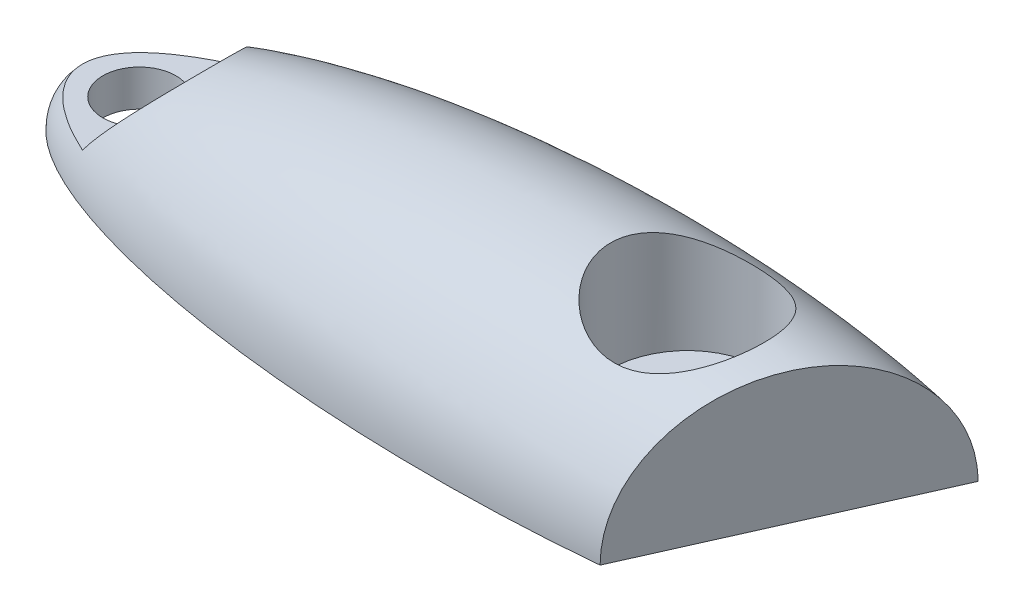
ISO-10303-21;
HEADER;
FILE_DESCRIPTION(('STEP AP214'),'2;1');
FILE_NAME('part.step','',(''),(''),'','','');
FILE_SCHEMA(('AUTOMOTIVE_DESIGN { 1 0 10303 214 1 1 1 1 }'));
ENDSEC;
DATA;
#1=APPLICATION_CONTEXT('core data for automotive mechanical design processes');
#2=APPLICATION_PROTOCOL_DEFINITION('international standard','automotive_design',2000,#1);
#3=PRODUCT_CONTEXT('',#1,'mechanical');
#4=PRODUCT('Part','Part','',(#3));
#5=PRODUCT_RELATED_PRODUCT_CATEGORY('part','',(#4));
#6=PRODUCT_DEFINITION_FORMATION('','',#4);
#7=PRODUCT_DEFINITION_CONTEXT('part definition',#1,'design');
#8=PRODUCT_DEFINITION('design','',#6,#7);
#9=PRODUCT_DEFINITION_SHAPE('','',#8);
#10=(LENGTH_UNIT() NAMED_UNIT(*) SI_UNIT(.MILLI.,.METRE.));
#11=(NAMED_UNIT(*) PLANE_ANGLE_UNIT() SI_UNIT($,.RADIAN.));
#12=(NAMED_UNIT(*) SI_UNIT($,.STERADIAN.) SOLID_ANGLE_UNIT());
#13=UNCERTAINTY_MEASURE_WITH_UNIT(LENGTH_MEASURE(1.E-05),#10,'distance_accuracy_value','');
#14=(GEOMETRIC_REPRESENTATION_CONTEXT(3) GLOBAL_UNCERTAINTY_ASSIGNED_CONTEXT((#13)) GLOBAL_UNIT_ASSIGNED_CONTEXT((#10,
#11,#12)) REPRESENTATION_CONTEXT('',''));
#15=CARTESIAN_POINT('',(0.,0.,0.));
#16=DIRECTION('',(0.,0.,1.));
#17=DIRECTION('',(1.,0.,0.));
#18=AXIS2_PLACEMENT_3D('',#15,#16,#17);
#19=CARTESIAN_POINT('',(0.,0.,0.));
#20=DIRECTION('',(0.,0.,1.));
#21=DIRECTION('',(1.,0.,0.));
#22=AXIS2_PLACEMENT_3D('',#19,#20,#21);
#23=ELLIPSE('',#22,14.,4.);
#24=TRIMMED_CURVE('',#23,(PARAMETER_VALUE(0.)),(PARAMETER_VALUE(3.14159265358979)),.T.,.PARAMETER.);
#25=CARTESIAN_POINT('',(-14.,0.,0.));
#26=DIRECTION('',(-1.,0.,0.));
#27=AXIS1_PLACEMENT('',#25,#26);
#28=SURFACE_OF_REVOLUTION('',#24,#27);
#29=CARTESIAN_POINT('',(-11.3323951907794,1.,2.1252));
#30=CARTESIAN_POINT('',(-11.4265744042541,1.,2.08417845847968));
#31=CARTESIAN_POINT('',(-11.5201698550588,1.,2.04176190730122));
#32=CARTESIAN_POINT('',(-11.7066294634315,1.,1.95329424459177));
#33=CARTESIAN_POINT('',(-11.7994800204758,1.,1.90721453449926));
#34=CARTESIAN_POINT('',(-11.9835471465858,1.,1.81110875110348));
#35=CARTESIAN_POINT('',(-12.0747567610729,1.,1.76106927455102));
#36=CARTESIAN_POINT('',(-12.259066942138,1.,1.65396510442188));
#37=CARTESIAN_POINT('',(-12.3520379175605,1.,1.59667535699381));
#38=CARTESIAN_POINT('',(-12.5339079018473,1.,1.47644312667415));
#39=CARTESIAN_POINT('',(-12.6228174805613,1.,1.41351674791652));
#40=CARTESIAN_POINT('',(-12.7951436133261,1.,1.28080462101648));
#41=CARTESIAN_POINT('',(-12.87857282396,1.,1.21103567724105));
#42=CARTESIAN_POINT('',(-12.9968432799639,1.,1.10099736436021));
#43=CARTESIAN_POINT('',(-13.0346735351993,1.,1.06393370969369));
#44=CARTESIAN_POINT('',(-13.10806733959,1.,0.987588364844233));
#45=CARTESIAN_POINT('',(-13.1436301768897,1.,0.948305985321438));
#46=CARTESIAN_POINT('',(-13.2117086116156,1.,0.867635183153819));
#47=CARTESIAN_POINT('',(-13.2442437659799,1.,0.826263395193402));
#48=CARTESIAN_POINT('',(-13.3058674281841,1.,0.74104537546988));
#49=CARTESIAN_POINT('',(-13.3349574863987,1.,0.697200269973906));
#50=CARTESIAN_POINT('',(-13.3991601394723,1.,0.589804203011926));
#51=CARTESIAN_POINT('',(-13.4323712443251,1.,0.525087327016342));
#52=CARTESIAN_POINT('',(-13.488192959068,1.,0.391125975155837));
#53=CARTESIAN_POINT('',(-13.5108109132442,1.,0.321884674163175));
#54=CARTESIAN_POINT('',(-13.5350353613219,1.,0.215454699559348));
#55=CARTESIAN_POINT('',(-13.5415016370635,1.,0.179337120401642));
#56=CARTESIAN_POINT('',(-13.5508972872285,1.,0.106651402143992));
#57=CARTESIAN_POINT('',(-13.5538283733748,1.,0.0700834897652159));
#58=CARTESIAN_POINT('',(-13.5560433121289,1.,-0.00316459548426473));
#59=CARTESIAN_POINT('',(-13.555327061842,1.,-0.0398447714928582));
#60=CARTESIAN_POINT('',(-13.5502817408031,1.,-0.112944648592692));
#61=CARTESIAN_POINT('',(-13.5459528737572,1.,-0.149364364253835));
#62=CARTESIAN_POINT('',(-13.5294250255249,1.,-0.247784835462933));
#63=CARTESIAN_POINT('',(-13.5137981809939,1.,-0.30923301865574));
#64=CARTESIAN_POINT('',(-13.4736549583255,1.,-0.429070233913826));
#65=CARTESIAN_POINT('',(-13.4491349804836,0.999999999999999,-0.487458016241136));
#66=CARTESIAN_POINT('',(-13.3756607173964,0.999999999999999,-0.635419242339245));
#67=CARTESIAN_POINT('',(-13.3209490400327,1.,-0.722119170667468));
#68=CARTESIAN_POINT('',(-13.1990455326632,1.,-0.886274419623377));
#69=CARTESIAN_POINT('',(-13.1318116413938,1.,-0.963697094117582));
#70=CARTESIAN_POINT('',(-12.9918230113215,1.,-1.10760006513132));
#71=CARTESIAN_POINT('',(-12.9193753805795,1.,-1.17438448311408));
#72=CARTESIAN_POINT('',(-12.7690974455616,1.,-1.30166180433138));
#73=CARTESIAN_POINT('',(-12.6912617166786,1.,-1.3621482088832));
#74=CARTESIAN_POINT('',(-12.5315112146063,1.,-1.4779685727839));
#75=CARTESIAN_POINT('',(-12.4495844326044,1.,-1.53328580631296));
#76=CARTESIAN_POINT('',(-12.2829007962956,1.,-1.6393545601126));
#77=CARTESIAN_POINT('',(-12.1981451381463,1.,-1.69010797742843));
#78=CARTESIAN_POINT('',(-11.9854869428068,1.,-1.8110332846165));
#79=CARTESIAN_POINT('',(-11.8562859594855,1.,-1.87892126127393));
#80=CARTESIAN_POINT('',(-11.6606616601892,1.,-1.97526559532136));
#81=CARTESIAN_POINT('',(-11.5954890885228,1.,-2.00632007432792));
#82=CARTESIAN_POINT('',(-11.4644449291603,1.,-2.06688197656395));
#83=CARTESIAN_POINT('',(-11.3985734911482,1.,-2.09638972334078));
#84=CARTESIAN_POINT('',(-11.3323951907794,1.,-2.1252));
#85=B_SPLINE_CURVE_WITH_KNOTS('',3,(#29,#30,#31,#32,#33,#34,#35,#36,#37,#38,#39,#40,#41,#42,#43,
#44,#45,#46,#47,#48,#49,#50,#51,#52,#53,#54,#55,#56,#57,#58,#59,#60,#61,#62,#63,#64,#65,#66,#67,
#68,#69,#70,#71,#72,#73,#74,#75,#76,#77,#78,#79,#80,#81,#82,#83,#84),.UNSPECIFIED.,.F.,.F.,(4,2,
2,2,2,2,2,2,2,2,2,2,2,2,2,2,2,2,2,2,2,2,2,2,2,2,2,4),(0.,0.308197864774815,0.619097115936735,
0.931097858750423,1.2585298228343,1.58505444508221,1.91079634639933,2.06960329763821,
2.22845986326112,2.38620637436928,2.54388162386346,2.76136992867584,2.97870722369306,
3.08863375203131,3.19850703304976,3.30838341371417,3.41825359915258,3.60760056996466,
3.7970242690986,4.10279876041959,4.40961948220797,4.70477437588822,5.00023087192482,
5.29661247194653,5.59287029972253,6.03042932247871,6.24699528805515,6.4635157698154),.UNSPECIFIED.);
#86=CARTESIAN_POINT('',(-11.5153947870645,1.,2.04332028512314));
#87=VERTEX_POINT('',#86);
#88=CARTESIAN_POINT('',(-11.5153947870645,1.,-2.04332028512313));
#89=VERTEX_POINT('',#88);
#90=EDGE_CURVE('E87',#87,#89,#85,.T.);
#91=ORIENTED_EDGE('',*,*,#90,.T.);
#92=CARTESIAN_POINT('',(-11.5153947870646,0.999999999999987,-2.04332028512314));
#93=CARTESIAN_POINT('',(-11.4859601713284,1.04190691100927,-2.03634523885614));
#94=CARTESIAN_POINT('',(-11.455939965631,1.08325950903699,-2.0285482251181));
#95=CARTESIAN_POINT('',(-11.3950274299691,1.16494465651603,-2.01121960072317));
#96=CARTESIAN_POINT('',(-11.3641351336836,1.20527724524499,-2.00168805697427));
#97=CARTESIAN_POINT('',(-11.3017245722681,1.28507884938627,-1.98078224239599));
#98=CARTESIAN_POINT('',(-11.2702053729221,1.32454635765365,-1.9694050071591));
#99=CARTESIAN_POINT('',(-11.2068188808601,1.40259172445675,-1.94474175527424));
#100=CARTESIAN_POINT('',(-11.1749515845317,1.44116957374683,-1.93145571879971));
#101=CARTESIAN_POINT('',(-11.0784092489901,1.55646704057423,-1.8882991714598));
#102=CARTESIAN_POINT('',(-11.0134943498303,1.63186758948024,-1.85535794092941));
#103=CARTESIAN_POINT('',(-10.8845250022668,1.77893399267751,-1.78080450727697));
#104=CARTESIAN_POINT('',(-10.8204698814206,1.85060290915535,-1.73919955840844));
#105=CARTESIAN_POINT('',(-10.7158093568559,1.96619043125952,-1.6623854108554));
#106=CARTESIAN_POINT('',(-10.6746024290106,2.01129405071702,-1.62977474945113));
#107=CARTESIAN_POINT('',(-10.593534182508,2.0994094031302,-1.56035415495191));
#108=CARTESIAN_POINT('',(-10.5536728704922,2.14242112576143,-1.52354420113458));
#109=CARTESIAN_POINT('',(-10.4370280416457,2.26757991065072,-1.40683070422024));
#110=CARTESIAN_POINT('',(-10.3628007176528,2.34627012824012,-1.32037110380086));
#111=CARTESIAN_POINT('',(-10.2413323694239,2.47414760496976,-1.15122792435654));
#112=CARTESIAN_POINT('',(-10.191797896957,2.52597016712455,-1.07218205439318));
#113=CARTESIAN_POINT('',(-10.1019159733054,2.61964813176993,-0.903531280911849));
#114=CARTESIAN_POINT('',(-10.0615608186204,2.66151189328356,-0.813935327836523));
#115=CARTESIAN_POINT('',(-9.99875156767703,2.72651627680485,-0.641796442949267));
#116=CARTESIAN_POINT('',(-9.97441195385856,2.75163921406036,-0.560693381317898));
#117=CARTESIAN_POINT('',(-9.93546616865047,2.79179367978033,-0.393719040930144));
#118=CARTESIAN_POINT('',(-9.9208532785694,2.8068321740827,-0.307851098003317));
#119=CARTESIAN_POINT('',(-9.90702346523332,2.82106017038962,-0.177180620327057));
#120=CARTESIAN_POINT('',(-9.90376387437008,2.82441237894233,-0.133198605734579));
#121=CARTESIAN_POINT('',(-9.90001807971665,2.8282643029202,-0.0449982264146429));
#122=CARTESIAN_POINT('',(-9.8995315457145,2.82876435797605,-0.000779890455715579));
#123=CARTESIAN_POINT('',(-9.90228087265955,2.82593778736616,0.131683714520757));
#124=CARTESIAN_POINT('',(-9.90971654018422,2.81829380344192,0.219823710555703));
#125=CARTESIAN_POINT('',(-9.93438925588672,2.79289626974398,0.387276021865792));
#126=CARTESIAN_POINT('',(-9.95097600742219,2.77581336178292,0.466793945712482));
#127=CARTESIAN_POINT('',(-9.99241963409492,2.73304738248871,0.621305808670344));
#128=CARTESIAN_POINT('',(-10.0172854467838,2.70735501673434,0.696294754776754));
#129=CARTESIAN_POINT('',(-10.0647052410367,2.65822751792861,0.816924487591546));
#130=CARTESIAN_POINT('',(-10.085368155482,2.63678918285027,0.864160316637053));
#131=CARTESIAN_POINT('',(-10.1294239921442,2.59098366698801,0.955785155020519));
#132=CARTESIAN_POINT('',(-10.152814354735,2.56661923162627,1.00017677388437));
#133=CARTESIAN_POINT('',(-10.2265983197503,2.48956964903853,1.12909668341846));
#134=CARTESIAN_POINT('',(-10.2805637749789,2.43297055893204,1.20926917572554));
#135=CARTESIAN_POINT('',(-10.4161908289538,2.28971041137473,1.384907184107));
#136=CARTESIAN_POINT('',(-10.5007745767453,2.1996146441049,1.47528330430638));
#137=CARTESIAN_POINT('',(-10.633065649834,2.05655971837734,1.59532397438186));
#138=CARTESIAN_POINT('',(-10.6781696033617,2.00744033733716,1.63281498475254));
#139=CARTESIAN_POINT('',(-10.7696549373239,1.90687058297786,1.70281095728899));
#140=CARTESIAN_POINT('',(-10.8160362443401,1.85542034351974,1.73531620531764));
#141=CARTESIAN_POINT('',(-10.9178500230823,1.74112635057216,1.80090017999656));
#142=CARTESIAN_POINT('',(-10.9734263830562,1.67788254322489,1.83305452243846));
#143=CARTESIAN_POINT('',(-11.0847745042003,1.5487341230641,1.89111198906212));
#144=CARTESIAN_POINT('',(-11.1405463195544,1.48282870853984,1.91701321308088));
#145=CARTESIAN_POINT('',(-11.2507648689872,1.34906990861896,1.96269306252423));
#146=CARTESIAN_POINT('',(-11.3052193298149,1.28124349078505,1.98253185321917));
#147=CARTESIAN_POINT('',(-11.385435224858,1.17742906952561,2.00825776311014));
#148=CARTESIAN_POINT('',(-11.4119227825773,1.14248792670499,2.01615947171));
#149=CARTESIAN_POINT('',(-11.4642182842788,1.07183726031344,2.0306838787472));
#150=CARTESIAN_POINT('',(-11.4900261930351,1.03612769708941,2.0373065110031));
#151=CARTESIAN_POINT('',(-11.5153947870645,0.999999999999999,2.04332028512314));
#152=B_SPLINE_CURVE_WITH_KNOTS('',3,(#92,#93,#94,#95,#96,#97,#98,#99,#100,#101,#102,#103,#104,
#105,#106,#107,#108,#109,#110,#111,#112,#113,#114,#115,#116,#117,#118,#119,#120,#121,#122,#123,
#124,#125,#126,#127,#128,#129,#130,#131,#132,#133,#134,#135,#136,#137,#138,#139,#140,#141,#142,
#143,#144,#145,#146,#147,#148,#149,#150,#151),.UNSPECIFIED.,.F.,.F.,(4,2,2,2,2,2,2,2,2,2,2,2,2,
2,2,2,2,2,2,2,2,2,2,2,2,2,2,2,2,4),(0.,0.155031943118094,0.310057907281269,0.465335373234537,
0.620614452157722,0.934611667428351,1.24834701802064,1.45593614470613,1.66352629583331,
2.07683365289286,2.3958591098661,2.71461583713452,2.97851445837018,3.24223060310824,
3.37476158783236,3.50727679061148,3.77204969297889,4.02006061362644,4.26834014402167,
4.43564331816613,4.60279072826943,4.93743141593806,5.39414137785018,5.6234992605279,
5.85284398785877,6.12294042620951,6.39311883695424,6.66052164261567,6.79415276442524,
6.92779079866801),.UNSPECIFIED.);
#153=EDGE_CURVE('E11',#89,#87,#152,.T.);
#154=ORIENTED_EDGE('',*,*,#153,.T.);
#155=EDGE_LOOP('',(#91,#154));
#156=FACE_BOUND('',#155,.T.);
#157=CARTESIAN_POINT('',(3.,3.29473915848417,-2.1));
#158=CARTESIAN_POINT('',(3.05323564065607,3.29078205374188,-2.10000009974272));
#159=CARTESIAN_POINT('',(3.1065578783204,3.2880002159463,-2.0979733731883));
#160=CARTESIAN_POINT('',(3.2129815165289,3.28482083705697,-2.08985357829542));
#161=CARTESIAN_POINT('',(3.26608283690777,3.28442409688184,-2.08375914477929));
#162=CARTESIAN_POINT('',(3.37168932876669,3.28596531806497,-2.06753543224233));
#163=CARTESIAN_POINT('',(3.4241938210235,3.28790571387055,-2.05740195336391));
#164=CARTESIAN_POINT('',(3.52816514357141,3.29398225325584,-2.03319854128278));
#165=CARTESIAN_POINT('',(3.57963154003895,3.2981192958648,-2.01912699745056));
#166=CARTESIAN_POINT('',(3.73146189735784,3.31348205744863,-1.97133498700218));
#167=CARTESIAN_POINT('',(3.82981057412224,3.32767123176844,-1.9319507657067));
#168=CARTESIAN_POINT('',(4.01862714492057,3.36174697061821,-1.83942537760752));
#169=CARTESIAN_POINT('',(4.10909314864192,3.38163489686647,-1.78628092308531));
#170=CARTESIAN_POINT('',(4.28618040158439,3.42599238689529,-1.66374936791056));
#171=CARTESIAN_POINT('',(4.37217589178639,3.45067491066483,-1.59353485789123));
#172=CARTESIAN_POINT('',(4.53199021532188,3.50072806236247,-1.44057444024457));
#173=CARTESIAN_POINT('',(4.60580336465583,3.52609900509893,-1.35782271738407));
#174=CARTESIAN_POINT('',(4.74576794220908,3.57700395118693,-1.17339564736072));
#175=CARTESIAN_POINT('',(4.81063936510287,3.60234868732724,-1.07068890517043));
#176=CARTESIAN_POINT('',(4.92206438864012,3.64750521563339,-0.854648129418324));
#177=CARTESIAN_POINT('',(4.96862411620023,3.66731885780489,-0.741317666194639));
#178=CARTESIAN_POINT('',(5.03998952116947,3.69825289238279,-0.512094930890462));
#179=CARTESIAN_POINT('',(5.06561915754758,3.70970046384844,-0.396505063512798));
#180=CARTESIAN_POINT('',(5.09705992186132,3.72379622054147,-0.162156642802536));
#181=CARTESIAN_POINT('',(5.10288226157556,3.72644938375893,-0.0433999204285153));
#182=CARTESIAN_POINT('',(5.09477596990768,3.72279024496986,0.183931039018082));
#183=CARTESIAN_POINT('',(5.08235856838343,3.71716386549574,0.29257429041795));
#184=CARTESIAN_POINT('',(5.04101711775818,3.69878445383673,0.506032590998359));
#185=CARTESIAN_POINT('',(5.01209231638229,3.68603109686193,0.610847465480547));
#186=CARTESIAN_POINT('',(4.93864636215171,3.6546295930951,0.814517152555641));
#187=CARTESIAN_POINT('',(4.89404391403968,3.63595077044006,0.913337688121254));
#188=CARTESIAN_POINT('',(4.79066267139066,3.59457113166628,1.1023352485955));
#189=CARTESIAN_POINT('',(4.73187874190275,3.57186885949481,1.19250912608354));
#190=CARTESIAN_POINT('',(4.59629737267865,3.52274040128265,1.36938801376545));
#191=CARTESIAN_POINT('',(4.51843312984136,3.49616157717184,1.45523435876094));
#192=CARTESIAN_POINT('',(4.3494760975426,3.44396282131316,1.61316859574032));
#193=CARTESIAN_POINT('',(4.25837501281132,3.41834350362634,1.68524779407449));
#194=CARTESIAN_POINT('',(4.06035982750744,3.3704289239457,1.81667891871836));
#195=CARTESIAN_POINT('',(3.95292855241969,3.34832793358771,1.8753367220765));
#196=CARTESIAN_POINT('',(3.78462423516751,3.32167880256365,1.94887901798933));
#197=CARTESIAN_POINT('',(3.727323598806,3.31387901434704,1.97098725436253));
#198=CARTESIAN_POINT('',(3.61075127753245,3.30085778358967,2.01016278490736));
#199=CARTESIAN_POINT('',(3.55148078254028,3.29563481365042,2.02723306289115));
#200=CARTESIAN_POINT('',(3.43696624079207,3.28845154494432,2.05480119009054));
#201=CARTESIAN_POINT('',(3.38184750894558,3.28623728624754,2.06575623325561));
#202=CARTESIAN_POINT('',(3.27087530466059,3.28438599225487,2.08321387137027));
#203=CARTESIAN_POINT('',(3.21502199771115,3.28474838607762,2.08971745223273));
#204=CARTESIAN_POINT('',(3.10307287509243,3.28811596278423,2.09821946863845));
#205=CARTESIAN_POINT('',(3.04697716402764,3.29112010079658,2.10021968425433));
#206=CARTESIAN_POINT('',(2.93499813856961,3.29972049066595,2.09974163861308));
#207=CARTESIAN_POINT('',(2.87911490405087,3.30531763562844,2.09726183345517));
#208=CARTESIAN_POINT('',(2.72209289005765,3.32461937978589,2.08401401783859));
#209=CARTESIAN_POINT('',(2.62169507247784,3.34120207754227,2.0680923733562));
#210=CARTESIAN_POINT('',(2.42548146089257,3.38102694537364,2.0223999530601));
#211=CARTESIAN_POINT('',(2.32966883801018,3.40427364877222,1.99261974105177));
#212=CARTESIAN_POINT('',(2.1869757148633,3.44361041201869,1.93697782145598));
#213=CARTESIAN_POINT('',(2.13783721409216,3.45808193916361,1.91560120952197));
#214=CARTESIAN_POINT('',(2.04163068549544,3.48802357864997,1.86932453284416));
#215=CARTESIAN_POINT('',(1.99456064526115,3.50349268258423,1.84442799679216));
#216=CARTESIAN_POINT('',(1.85656861266099,3.55095542737473,1.76461334371934));
#217=CARTESIAN_POINT('',(1.7689039404754,3.58399325525024,1.70458561031329));
#218=CARTESIAN_POINT('',(1.59260317875426,3.65473054807812,1.56322064481053));
#219=CARTESIAN_POINT('',(1.50540434729021,3.69246268692671,1.48010735349747));
#220=CARTESIAN_POINT('',(1.34587869277522,3.76479955398534,1.29938567603225));
#221=CARTESIAN_POINT('',(1.27355610643288,3.79940338969597,1.20177317414291));
#222=CARTESIAN_POINT('',(1.1454495576467,3.86257020637958,0.99287508213343));
#223=CARTESIAN_POINT('',(1.08984631808028,3.89106628292532,0.881457270058123));
#224=CARTESIAN_POINT('',(0.998841974642897,3.9385075973657,0.648784808205796));
#225=CARTESIAN_POINT('',(0.963418811643321,3.95746326136846,0.527541065597683));
#226=CARTESIAN_POINT('',(0.917530271937132,3.98216900171497,0.293197945372226));
#227=CARTESIAN_POINT('',(0.904736193615527,3.98914862749445,0.180682731240902));
#228=CARTESIAN_POINT('',(0.897452876956478,3.9931118980439,-0.0450972785597286));
#229=CARTESIAN_POINT('',(0.902955766071048,3.99009984188799,-0.158361730927603));
#230=CARTESIAN_POINT('',(0.930810178597976,3.97501146259431,-0.373207731260486));
#231=CARTESIAN_POINT('',(0.95183220425833,3.96365069143025,-0.475017472035147));
#232=CARTESIAN_POINT('',(1.00823399344627,3.93365542797675,-0.673431427157249));
#233=CARTESIAN_POINT('',(1.04361567532378,3.91501996385176,-0.770034944035431));
#234=CARTESIAN_POINT('',(1.1291464591649,3.8710168112222,-0.959782466112473));
#235=CARTESIAN_POINT('',(1.17984221957592,3.84540413353734,-1.05262159699771));
#236=CARTESIAN_POINT('',(1.29378642041109,3.78976436075137,-1.22876066852618));
#237=CARTESIAN_POINT('',(1.3570396134616,3.75973559540724,-1.31205697860512));
#238=CARTESIAN_POINT('',(1.50240799285959,3.69382477733543,-1.47668225795648));
#239=CARTESIAN_POINT('',(1.58584469234783,3.65766429834799,-1.5567352926695));
#240=CARTESIAN_POINT('',(1.76478348028289,3.58545001733491,-1.70222604333839));
#241=CARTESIAN_POINT('',(1.86030004556387,3.54939639732888,-1.76764595771122));
#242=CARTESIAN_POINT('',(2.06897932176804,3.47822796471117,-1.88641716585113));
#243=CARTESIAN_POINT('',(2.18291153096176,3.44335880226536,-1.93859151849693));
#244=CARTESIAN_POINT('',(2.36058338863161,3.3972013730774,-2.00127288120147));
#245=CARTESIAN_POINT('',(2.42088294356431,3.38284940258099,-2.01956116142009));
#246=CARTESIAN_POINT('',(2.54338353165548,3.35666048943391,-2.05072827255502));
#247=CARTESIAN_POINT('',(2.60558328206535,3.34482189121853,-2.06361066983655));
#248=CARTESIAN_POINT('',(2.72295268712443,3.32548407661616,-2.08237629054973));
#249=CARTESIAN_POINT('',(2.77795012557741,3.3176162742026,-2.08896512412316));
#250=CARTESIAN_POINT('',(2.88860000381657,3.30431557682432,-2.09777718744419));
#251=CARTESIAN_POINT('',(2.944252521069,3.2988829728636,-2.09999989555108));
#252=CARTESIAN_POINT('',(3.,3.29473915848417,-2.1));
#253=B_SPLINE_CURVE_WITH_KNOTS('',3,(#157,#158,#159,#160,#161,#162,#163,#164,#165,#166,#167,
#168,#169,#170,#171,#172,#173,#174,#175,#176,#177,#178,#179,#180,#181,#182,#183,#184,#185,#186,
#187,#188,#189,#190,#191,#192,#193,#194,#195,#196,#197,#198,#199,#200,#201,#202,#203,#204,#205,
#206,#207,#208,#209,#210,#211,#212,#213,#214,#215,#216,#217,#218,#219,#220,#221,#222,#223,#224,
#225,#226,#227,#228,#229,#230,#231,#232,#233,#234,#235,#236,#237,#238,#239,#240,#241,#242,#243,
#244,#245,#246,#247,#248,#249,#250,#251,#252),.UNSPECIFIED.,.T.,.F.,(4,2,2,2,2,2,2,2,2,2,2,2,2,
2,2,2,2,2,2,2,2,2,2,2,2,2,2,2,2,2,2,2,2,2,2,2,2,2,2,2,2,2,2,2,2,2,2,4),(0.,0.160093414048469,
0.320240584655434,0.480554714844936,0.640934507984883,0.960034779278076,1.27921136334266,
1.6190038525484,1.95895443563139,2.32937974531614,2.69968100860853,3.05458675002766,
3.409291566134,3.73621499420115,4.06315332200579,4.39181260101362,4.72059106284317,
5.07574599084318,5.43112445519496,5.80203841645822,5.98753377021684,6.17291903986598,
6.34140952541036,6.5098626814827,6.67824924035106,6.84669383951589,7.15425310313378,
7.46202208864091,7.62839948584618,7.7946112585578,8.1271643788661,8.5041808883283,
8.88130462271306,9.26236922596118,9.6430164788373,9.98152680431842,10.3198914994443,
10.6322111710375,10.9445725801018,11.2697584687384,11.5950676662995,11.9569802712376,
12.3193307865592,12.7072431782784,12.9008753485996,13.0943795744479,13.2620067133768,
13.4296538782587),.UNSPECIFIED.);
#254=CARTESIAN_POINT('',(3.,3.29473915848417,-2.1));
#255=VERTEX_POINT('',#254);
#256=EDGE_CURVE('E90',#255,#255,#253,.T.);
#257=ORIENTED_EDGE('',*,*,#256,.T.);
#258=EDGE_LOOP('',(#257));
#259=FACE_BOUND('',#258,.T.);
#260=CARTESIAN_POINT('',(0.,0.,0.));
#261=DIRECTION('',(0.,-1.,0.));
#262=DIRECTION('',(1.,0.,0.));
#263=AXIS2_PLACEMENT_3D('',#260,#261,#262);
#264=ELLIPSE('',#263,14.,4.);
#265=CARTESIAN_POINT('',(-14.,0.,0.));
#266=VERTEX_POINT('',#265);
#267=CARTESIAN_POINT('',(4.40670097605298,0.,3.79667939241491));
#268=VERTEX_POINT('',#267);
#269=EDGE_CURVE('E76',#266,#268,#264,.F.);
#270=ORIENTED_EDGE('',*,*,#269,.T.);
#271=CARTESIAN_POINT('',(4.40670097605298,0.,3.79667939241491));
#272=CARTESIAN_POINT('',(4.40669506095265,0.0954451677102484,3.79669267794777));
#273=CARTESIAN_POINT('',(4.40837386075897,0.190883265279699,3.79292203184675));
#274=CARTESIAN_POINT('',(4.41505548522846,0.381034200037716,3.77791485757887));
#275=CARTESIAN_POINT('',(4.42005761785639,0.475747184067997,3.76667988374859));
#276=CARTESIAN_POINT('',(4.4333218893392,0.663513099944659,3.73688784221914));
#277=CARTESIAN_POINT('',(4.44157483497335,0.756569946309505,3.71835142283181));
#278=CARTESIAN_POINT('',(4.46124648422322,0.940613409989334,3.67416817521325));
#279=CARTESIAN_POINT('',(4.47266524875575,1.03159998743166,3.64852121016063));
#280=CARTESIAN_POINT('',(4.51150546359281,1.30045389038749,3.56128465933026));
#281=CARTESIAN_POINT('',(4.5435272150018,1.47444367077006,3.48936262810084));
#282=CARTESIAN_POINT('',(4.61859878804581,1.80728781700393,3.32074911436917));
#283=CARTESIAN_POINT('',(4.66165306919569,1.96613602669693,3.22404761563254));
#284=CARTESIAN_POINT('',(4.75899622213345,2.27050113581843,3.00541131444653));
#285=CARTESIAN_POINT('',(4.81362305533088,2.41536428244689,2.88271743824316));
#286=CARTESIAN_POINT('',(4.93137636295992,2.68240290606545,2.61823917905949));
#287=CARTESIAN_POINT('',(4.99450573045008,2.80457062693392,2.47644829816327));
#288=CARTESIAN_POINT('',(5.13248149587818,3.03245384666083,2.16654965510418));
#289=CARTESIAN_POINT('',(5.20785121595557,3.13625366212091,1.9972664921715));
#290=CARTESIAN_POINT('',(5.36423503913502,3.31374195283534,1.64602267446671));
#291=CARTESIAN_POINT('',(5.44525082043715,3.38742143024296,1.46405825039554));
#292=CARTESIAN_POINT('',(5.61705145544934,3.50804364117185,1.07818770637806));
#293=CARTESIAN_POINT('',(5.70811491733367,3.55259330209817,0.873655822226839));
#294=CARTESIAN_POINT('',(5.89198206553988,3.60526009527358,0.460683445842779));
#295=CARTESIAN_POINT('',(5.98478629943601,3.6133655639594,0.252241723738062));
#296=CARTESIAN_POINT('',(6.17386911691271,3.59258541834119,-0.172445237628019));
#297=CARTESIAN_POINT('',(6.27011766757648,3.56203084938337,-0.388623021853833));
#298=CARTESIAN_POINT('',(6.45921000286172,3.4613511563525,-0.813331360567904));
#299=CARTESIAN_POINT('',(6.55205351062877,3.39122282221123,-1.02186129323095));
#300=CARTESIAN_POINT('',(6.68621663231701,3.25759351496756,-1.32319659824453));
#301=CARTESIAN_POINT('',(6.72998246442217,3.20847162168025,-1.42149626659325));
#302=CARTESIAN_POINT('',(6.81558390504109,3.10097093556943,-1.61376025012252));
#303=CARTESIAN_POINT('',(6.85742036702763,3.04259628748171,-1.70772648223434));
#304=CARTESIAN_POINT('',(6.93880484197512,2.91685088770853,-1.89051900579128));
#305=CARTESIAN_POINT('',(6.97835236416228,2.84947821691534,-1.97934419494045));
#306=CARTESIAN_POINT('',(7.05475602317665,2.70614120757188,-2.15094962274756));
#307=CARTESIAN_POINT('',(7.09161352684911,2.63018128307867,-2.23373293139022));
#308=CARTESIAN_POINT('',(7.16023915420569,2.47471834376447,-2.38786861406534));
#309=CARTESIAN_POINT('',(7.19217811518383,2.39567104001238,-2.45960469494254));
#310=CARTESIAN_POINT('',(7.25301245950309,2.23084687550559,-2.59624086939995));
#311=CARTESIAN_POINT('',(7.2819093079608,2.14507328925983,-2.6611442536859));
#312=CARTESIAN_POINT('',(7.33636992441925,1.96732466308144,-2.78346480098108));
#313=CARTESIAN_POINT('',(7.36193317273256,1.8753486596133,-2.84088079675321));
#314=CARTESIAN_POINT('',(7.40942402539431,1.68589139491806,-2.94754699825557));
#315=CARTESIAN_POINT('',(7.43135205908602,1.58841078564766,-2.99679816830657));
#316=CARTESIAN_POINT('',(7.46966530631341,1.39692076982994,-3.08285113050697));
#317=CARTESIAN_POINT('',(7.48635757841271,1.30328212904811,-3.12034258748201));
#318=CARTESIAN_POINT('',(7.5162688391271,1.11271348124828,-3.18752437900038));
#319=CARTESIAN_POINT('',(7.52948820864578,1.01578383650141,-3.21721556906716));
#320=CARTESIAN_POINT('',(7.55228188443036,0.819564071231578,-3.26841100309176));
#321=CARTESIAN_POINT('',(7.56186291151753,0.720278666496817,-3.28993034226133));
#322=CARTESIAN_POINT('',(7.57729643191883,0.52001713254781,-3.32459459663346));
#323=CARTESIAN_POINT('',(7.5831512181363,0.419042082378244,-3.33774466178123));
#324=CARTESIAN_POINT('',(7.58917282242156,0.264824131153528,-3.35126940644381));
#325=CARTESIAN_POINT('',(7.59072085176336,0.211886921666047,-3.35474633727259));
#326=CARTESIAN_POINT('',(7.59278327864725,0.105968901527425,-3.35937862389731));
#327=CARTESIAN_POINT('',(7.59329919123536,0.0529882691592439,-3.36053738254231));
#328=CARTESIAN_POINT('',(7.59329902394702,0.,-3.36053700680655));
#329=B_SPLINE_CURVE_WITH_KNOTS('',3,(#271,#272,#273,#274,#275,#276,#277,#278,#279,#280,#281,
#282,#283,#284,#285,#286,#287,#288,#289,#290,#291,#292,#293,#294,#295,#296,#297,#298,#299,#300,
#301,#302,#303,#304,#305,#306,#307,#308,#309,#310,#311,#312,#313,#314,#315,#316,#317,#318,#319,
#320,#321,#322,#323,#324,#325,#326,#327,#328),.UNSPECIFIED.,.F.,.F.,(4,2,2,2,2,2,2,2,2,2,2,2,2,
2,2,2,2,2,2,2,2,2,2,2,2,2,2,2,4),(0.,0.286234212329232,0.572408839262489,0.857779915510357,
1.14315648326106,1.71322294661514,2.28352020392204,2.87360417199576,3.4638894307312,
4.09835392487795,4.73300781430667,5.41481287879835,6.09683613198437,6.80933240291752,
7.52188647705587,7.87636554558223,8.23068627299851,8.58508269135342,8.939297762605,
9.27312121960289,9.60678316068522,9.94049705555469,10.274171508448,10.5804861286679,
10.886767138647,11.1924795955823,11.4980037532109,11.6571720230272,11.8161064775186),.UNSPECIFIED.);
#330=CARTESIAN_POINT('',(7.59329902394702,0.,-3.36053700680655));
#331=VERTEX_POINT('',#330);
#332=EDGE_CURVE('E53',#268,#331,#329,.T.);
#333=ORIENTED_EDGE('',*,*,#332,.T.);
#334=CARTESIAN_POINT('',(0.,0.,0.));
#335=DIRECTION('',(0.,1.,0.));
#336=DIRECTION('',(1.,0.,0.));
#337=AXIS2_PLACEMENT_3D('',#334,#335,#336);
#338=ELLIPSE('',#337,14.,4.);
#339=EDGE_CURVE('E47',#331,#266,#338,.T.);
#340=ORIENTED_EDGE('',*,*,#339,.T.);
#341=EDGE_LOOP('',(#270,#333,#340));
#342=FACE_BOUND('',#341,.T.);
#343=ADVANCED_FACE('F33',(#156,#259,#342),#28,.T.);
#344=CARTESIAN_POINT('',(-26.9157785627443,0.,-4.));
#345=DIRECTION('',(0.,1.,0.));
#346=DIRECTION('',(0.,0.,1.));
#347=AXIS2_PLACEMENT_3D('',#344,#345,#346);
#348=PLANE('',#347);
#349=CARTESIAN_POINT('',(-12.,0.,0.));
#350=DIRECTION('',(0.,-1.,0.));
#351=DIRECTION('',(0.,0.,-1.));
#352=AXIS2_PLACEMENT_3D('',#349,#350,#351);
#353=CIRCLE('',#352,1.);
#354=CARTESIAN_POINT('',(-12.,0.,-1.));
#355=VERTEX_POINT('',#354);
#356=EDGE_CURVE('E81',#355,#355,#353,.T.);
#357=ORIENTED_EDGE('',*,*,#356,.F.);
#358=EDGE_LOOP('',(#357));
#359=FACE_BOUND('',#358,.T.);
#360=CARTESIAN_POINT('',(3.,0.,0.));
#361=DIRECTION('',(0.,-1.,0.));
#362=DIRECTION('',(0.,0.,-1.));
#363=AXIS2_PLACEMENT_3D('',#360,#361,#362);
#364=CIRCLE('',#363,1.);
#365=CARTESIAN_POINT('',(3.,0.,-1.));
#366=VERTEX_POINT('',#365);
#367=EDGE_CURVE('E96',#366,#366,#364,.T.);
#368=ORIENTED_EDGE('',*,*,#367,.F.);
#369=EDGE_LOOP('',(#368));
#370=FACE_BOUND('',#369,.T.);
#371=ORIENTED_EDGE('',*,*,#339,.F.);
#372=DIRECTION('',(0.406736643075798,0.,-0.913545457642602));
#373=VECTOR('',#372,1.);
#374=CARTESIAN_POINT('',(5.08842105833564,0.,2.26551101809903));
#375=LINE('',#374,#373);
#376=EDGE_CURVE('E68',#268,#331,#375,.T.);
#377=ORIENTED_EDGE('',*,*,#376,.F.);
#378=ORIENTED_EDGE('',*,*,#269,.F.);
#379=EDGE_LOOP('',(#371,#377,#378));
#380=FACE_BOUND('',#379,.T.);
#381=ADVANCED_FACE('F79',(#359,#370,#380),#348,.F.);
#382=CARTESIAN_POINT('',(3.,4.,0.));
#383=DIRECTION('',(0.,-1.,0.));
#384=DIRECTION('',(0.,0.,-1.));
#385=AXIS2_PLACEMENT_3D('',#382,#383,#384);
#386=CYLINDRICAL_SURFACE('',#385,1.);
#387=CARTESIAN_POINT('',(3.,1.,0.));
#388=DIRECTION('',(0.,-1.,0.));
#389=DIRECTION('',(0.,0.,-1.));
#390=AXIS2_PLACEMENT_3D('',#387,#388,#389);
#391=CIRCLE('',#390,1.);
#392=CARTESIAN_POINT('',(3.,1.,-1.));
#393=VERTEX_POINT('',#392);
#394=EDGE_CURVE('E88',#393,#393,#391,.F.);
#395=ORIENTED_EDGE('',*,*,#394,.T.);
#396=EDGE_LOOP('',(#395));
#397=FACE_BOUND('',#396,.T.);
#398=ORIENTED_EDGE('',*,*,#367,.T.);
#399=EDGE_LOOP('',(#398));
#400=FACE_BOUND('',#399,.T.);
#401=ADVANCED_FACE('F109',(#397,#400),#386,.F.);
#402=CARTESIAN_POINT('',(-12.,4.,0.));
#403=DIRECTION('',(0.,-1.,0.));
#404=DIRECTION('',(0.,0.,-1.));
#405=AXIS2_PLACEMENT_3D('',#402,#403,#404);
#406=CYLINDRICAL_SURFACE('',#405,1.);
#407=CARTESIAN_POINT('',(-12.,1.,0.));
#408=DIRECTION('',(0.,-1.,0.));
#409=DIRECTION('',(0.,0.,-1.));
#410=AXIS2_PLACEMENT_3D('',#407,#408,#409);
#411=CIRCLE('',#410,1.);
#412=CARTESIAN_POINT('',(-12.,1.,-1.));
#413=VERTEX_POINT('',#412);
#414=EDGE_CURVE('E84',#413,#413,#411,.F.);
#415=ORIENTED_EDGE('',*,*,#414,.T.);
#416=EDGE_LOOP('',(#415));
#417=FACE_BOUND('',#416,.T.);
#418=ORIENTED_EDGE('',*,*,#356,.T.);
#419=EDGE_LOOP('',(#418));
#420=FACE_BOUND('',#419,.T.);
#421=ADVANCED_FACE('F105',(#417,#420),#406,.F.);
#422=CARTESIAN_POINT('',(-12.,4.,0.));
#423=DIRECTION('',(0.,-1.,0.));
#424=DIRECTION('',(0.,0.,-1.));
#425=AXIS2_PLACEMENT_3D('',#422,#423,#424);
#426=CYLINDRICAL_SURFACE('',#425,2.1);
#427=CARTESIAN_POINT('',(-12.,1.,0.));
#428=DIRECTION('',(0.,-1.,0.));
#429=DIRECTION('',(0.,0.,-1.));
#430=AXIS2_PLACEMENT_3D('',#427,#428,#429);
#431=CIRCLE('',#430,2.1);
#432=EDGE_CURVE('E60',#89,#87,#431,.T.);
#433=ORIENTED_EDGE('',*,*,#432,.T.);
#434=ORIENTED_EDGE('',*,*,#153,.F.);
#435=EDGE_LOOP('',(#433,#434));
#436=FACE_BOUND('',#435,.T.);
#437=ADVANCED_FACE('F108',(#436),#426,.F.);
#438=CARTESIAN_POINT('',(-12.,1.,0.));
#439=DIRECTION('',(0.,-1.,0.));
#440=DIRECTION('',(0.,0.,-1.));
#441=AXIS2_PLACEMENT_3D('',#438,#439,#440);
#442=PLANE('',#441);
#443=ORIENTED_EDGE('',*,*,#414,.F.);
#444=EDGE_LOOP('',(#443));
#445=FACE_BOUND('',#444,.T.);
#446=ORIENTED_EDGE('',*,*,#432,.F.);
#447=ORIENTED_EDGE('',*,*,#90,.F.);
#448=EDGE_LOOP('',(#446,#447));
#449=FACE_BOUND('',#448,.T.);
#450=ADVANCED_FACE('F103',(#445,#449),#442,.F.);
#451=CARTESIAN_POINT('',(3.,4.,0.));
#452=DIRECTION('',(0.,-1.,0.));
#453=DIRECTION('',(0.,0.,-1.));
#454=AXIS2_PLACEMENT_3D('',#451,#452,#453);
#455=CYLINDRICAL_SURFACE('',#454,2.1);
#456=CARTESIAN_POINT('',(3.,1.,0.));
#457=DIRECTION('',(0.,-1.,0.));
#458=DIRECTION('',(0.,0.,-1.));
#459=AXIS2_PLACEMENT_3D('',#456,#457,#458);
#460=CIRCLE('',#459,2.1);
#461=CARTESIAN_POINT('',(3.,1.,-2.1));
#462=VERTEX_POINT('',#461);
#463=EDGE_CURVE('E77',#462,#462,#460,.T.);
#464=ORIENTED_EDGE('',*,*,#463,.T.);
#465=EDGE_LOOP('',(#464));
#466=FACE_BOUND('',#465,.T.);
#467=ORIENTED_EDGE('',*,*,#256,.F.);
#468=EDGE_LOOP('',(#467));
#469=FACE_BOUND('',#468,.T.);
#470=ADVANCED_FACE('F97',(#466,#469),#455,.F.);
#471=CARTESIAN_POINT('',(3.,1.,0.));
#472=DIRECTION('',(0.,-1.,0.));
#473=DIRECTION('',(0.,0.,-1.));
#474=AXIS2_PLACEMENT_3D('',#471,#472,#473);
#475=PLANE('',#474);
#476=ORIENTED_EDGE('',*,*,#463,.F.);
#477=EDGE_LOOP('',(#476));
#478=FACE_BOUND('',#477,.T.);
#479=ORIENTED_EDGE('',*,*,#394,.F.);
#480=EDGE_LOOP('',(#479));
#481=FACE_BOUND('',#480,.T.);
#482=ADVANCED_FACE('F102',(#478,#481),#475,.F.);
#483=CARTESIAN_POINT('',(5.08842105833564,4.,2.26551101809903));
#484=DIRECTION('',(-0.913545457642602,0.,-0.406736643075798));
#485=DIRECTION('',(-0.406736643075798,0.,0.913545457642602));
#486=AXIS2_PLACEMENT_3D('',#483,#484,#485);
#487=PLANE('',#486);
#488=ORIENTED_EDGE('',*,*,#376,.T.);
#489=ORIENTED_EDGE('',*,*,#332,.F.);
#490=EDGE_LOOP('',(#488,#489));
#491=FACE_BOUND('',#490,.T.);
#492=ADVANCED_FACE('F69',(#491),#487,.F.);
#493=CLOSED_SHELL('',(#343,#381,#401,#421,#437,#450,#470,#482,#492));
#494=MANIFOLD_SOLID_BREP('B2',#493);
#495=ADVANCED_BREP_SHAPE_REPRESENTATION('',(#18,#494),#14);
#496=SHAPE_DEFINITION_REPRESENTATION(#9,#495);
ENDSEC;
END-ISO-10303-21;
